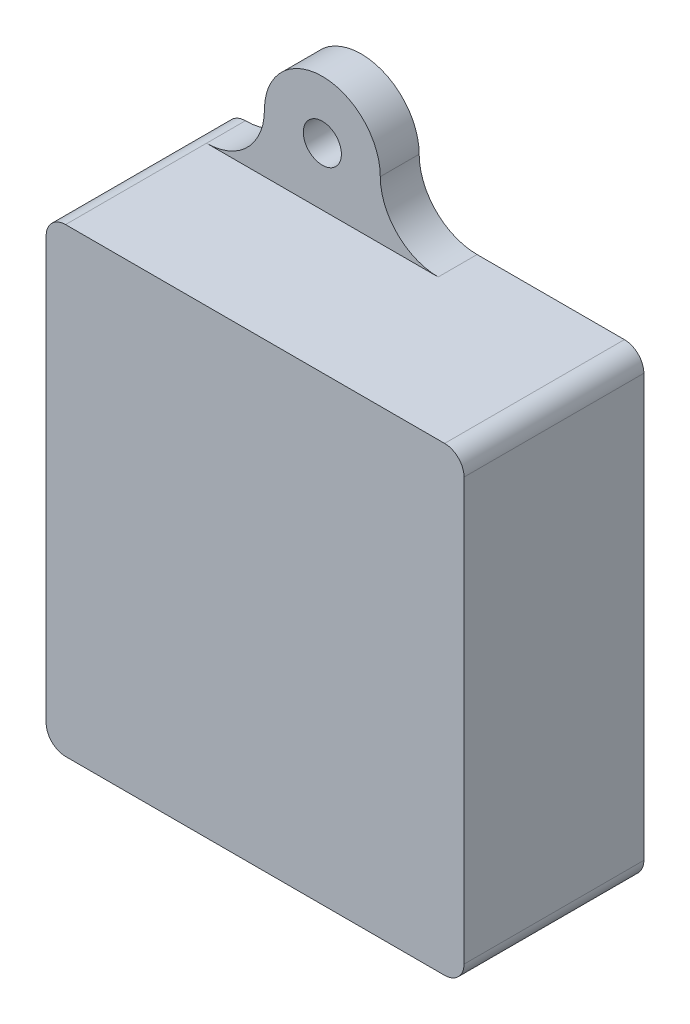
ISO-10303-21;
HEADER;
FILE_DESCRIPTION(('STEP AP214'),'2;1');
FILE_NAME('part.step','',(''),(''),'','','');
FILE_SCHEMA(('AUTOMOTIVE_DESIGN { 1 0 10303 214 1 1 1 1 }'));
ENDSEC;
DATA;
#1=APPLICATION_CONTEXT('core data for automotive mechanical design processes');
#2=APPLICATION_PROTOCOL_DEFINITION('international standard','automotive_design',2000,#1);
#3=PRODUCT_CONTEXT('',#1,'mechanical');
#4=PRODUCT('Part','Part','',(#3));
#5=PRODUCT_RELATED_PRODUCT_CATEGORY('part','',(#4));
#6=PRODUCT_DEFINITION_FORMATION('','',#4);
#7=PRODUCT_DEFINITION_CONTEXT('part definition',#1,'design');
#8=PRODUCT_DEFINITION('design','',#6,#7);
#9=PRODUCT_DEFINITION_SHAPE('','',#8);
#10=(LENGTH_UNIT() NAMED_UNIT(*) SI_UNIT(.MILLI.,.METRE.));
#11=(NAMED_UNIT(*) PLANE_ANGLE_UNIT() SI_UNIT($,.RADIAN.));
#12=(NAMED_UNIT(*) SI_UNIT($,.STERADIAN.) SOLID_ANGLE_UNIT());
#13=UNCERTAINTY_MEASURE_WITH_UNIT(LENGTH_MEASURE(1.E-05),#10,'distance_accuracy_value','');
#14=(GEOMETRIC_REPRESENTATION_CONTEXT(3) GLOBAL_UNCERTAINTY_ASSIGNED_CONTEXT((#13)) GLOBAL_UNIT_ASSIGNED_CONTEXT((#10,
#11,#12)) REPRESENTATION_CONTEXT('',''));
#15=CARTESIAN_POINT('',(0.,0.,0.));
#16=DIRECTION('',(0.,0.,1.));
#17=DIRECTION('',(1.,0.,0.));
#18=AXIS2_PLACEMENT_3D('',#15,#16,#17);
#19=CARTESIAN_POINT('',(2.54000000000002,60.198,23.495));
#20=DIRECTION('',(0.,1.,0.));
#21=DIRECTION('',(0.,0.,1.));
#22=AXIS2_PLACEMENT_3D('',#19,#20,#21);
#23=PLANE('',#22);
#24=DIRECTION('',(1.,0.,0.));
#25=VECTOR('',#24,1.);
#26=CARTESIAN_POINT('',(2.54000000000002,60.198,0.));
#27=LINE('',#26,#25);
#28=CARTESIAN_POINT('',(32.8168,60.198,0.));
#29=VERTEX_POINT('',#28);
#30=CARTESIAN_POINT('',(52.07,60.198,0.));
#31=VERTEX_POINT('',#30);
#32=EDGE_CURVE('E370',#29,#31,#27,.T.);
#33=ORIENTED_EDGE('',*,*,#32,.F.);
#34=DIRECTION('',(0.,0.,-1.));
#35=VECTOR('',#34,1.);
#36=CARTESIAN_POINT('',(32.8168,60.198,5.08));
#37=LINE('',#36,#35);
#38=CARTESIAN_POINT('',(32.8168,60.198,5.08));
#39=VERTEX_POINT('',#38);
#40=EDGE_CURVE('E306',#39,#29,#37,.T.);
#41=ORIENTED_EDGE('',*,*,#40,.F.);
#42=DIRECTION('',(1.,0.,0.));
#43=VECTOR('',#42,1.);
#44=CARTESIAN_POINT('',(0.,60.198,5.08));
#45=LINE('',#44,#43);
#46=CARTESIAN_POINT('',(2.54000000000002,60.198,5.08));
#47=VERTEX_POINT('',#46);
#48=EDGE_CURVE('E282',#47,#39,#45,.T.);
#49=ORIENTED_EDGE('',*,*,#48,.F.);
#50=DIRECTION('',(0.,0.,-1.));
#51=VECTOR('',#50,1.);
#52=CARTESIAN_POINT('',(2.54000000000002,60.198,23.495));
#53=LINE('',#52,#51);
#54=CARTESIAN_POINT('',(2.54000000000002,60.198,23.495));
#55=VERTEX_POINT('',#54);
#56=EDGE_CURVE('E396',#55,#47,#53,.T.);
#57=ORIENTED_EDGE('',*,*,#56,.F.);
#58=DIRECTION('',(1.,0.,0.));
#59=VECTOR('',#58,1.);
#60=CARTESIAN_POINT('',(2.54000000000002,60.198,23.495));
#61=LINE('',#60,#59);
#62=CARTESIAN_POINT('',(52.07,60.198,23.495));
#63=VERTEX_POINT('',#62);
#64=EDGE_CURVE('E348',#55,#63,#61,.T.);
#65=ORIENTED_EDGE('',*,*,#64,.T.);
#66=DIRECTION('',(0.,0.,-1.));
#67=VECTOR('',#66,1.);
#68=CARTESIAN_POINT('',(52.07,60.198,23.495));
#69=LINE('',#68,#67);
#70=EDGE_CURVE('E393',#63,#31,#69,.T.);
#71=ORIENTED_EDGE('',*,*,#70,.T.);
#72=EDGE_LOOP('',(#33,#41,#49,#57,#65,#71));
#73=FACE_BOUND('',#72,.T.);
#74=ADVANCED_FACE('F34',(#73),#23,.T.);
#75=CARTESIAN_POINT('',(2.54,2.54,0.));
#76=DIRECTION('',(0.,0.,-1.));
#77=DIRECTION('',(-1.,0.,0.));
#78=AXIS2_PLACEMENT_3D('',#75,#76,#77);
#79=PLANE('',#78);
#80=DIRECTION('',(-1.,0.,0.));
#81=VECTOR('',#80,1.);
#82=CARTESIAN_POINT('',(54.611,5.96900000000002,0.));
#83=LINE('',#82,#81);
#84=CARTESIAN_POINT('',(2.37689755157233,5.96900000000002,0.));
#85=VERTEX_POINT('',#84);
#86=CARTESIAN_POINT('',(1.27,5.96900000000002,0.));
#87=VERTEX_POINT('',#86);
#88=EDGE_CURVE('E608',#85,#87,#83,.T.);
#89=ORIENTED_EDGE('',*,*,#88,.F.);
#90=CARTESIAN_POINT('',(2.37689755157233,4.69900000000002,0.));
#91=DIRECTION('',(0.,0.,-1.));
#92=DIRECTION('',(-1.,0.,0.));
#93=AXIS2_PLACEMENT_3D('',#90,#91,#92);
#94=CIRCLE('',#93,1.27);
#95=CARTESIAN_POINT('',(3.57426503438155,5.12233333333335,0.));
#96=VERTEX_POINT('',#95);
#97=EDGE_CURVE('E451',#85,#96,#94,.T.);
#98=ORIENTED_EDGE('',*,*,#97,.T.);
#99=CARTESIAN_POINT('',(5.969,5.969,0.));
#100=DIRECTION('',(0.,0.,-1.));
#101=DIRECTION('',(-1.,0.,0.));
#102=AXIS2_PLACEMENT_3D('',#99,#100,#101);
#103=CIRCLE('',#102,2.54);
#104=CARTESIAN_POINT('',(5.969,3.429,0.));
#105=VERTEX_POINT('',#104);
#106=EDGE_CURVE('E433',#96,#105,#103,.F.);
#107=ORIENTED_EDGE('',*,*,#106,.T.);
#108=DIRECTION('',(1.,0.,0.));
#109=VECTOR('',#108,1.);
#110=CARTESIAN_POINT('',(2.54,3.429,0.));
#111=LINE('',#110,#109);
#112=CARTESIAN_POINT('',(48.641,3.429,0.));
#113=VERTEX_POINT('',#112);
#114=EDGE_CURVE('E328',#105,#113,#111,.T.);
#115=ORIENTED_EDGE('',*,*,#114,.T.);
#116=CARTESIAN_POINT('',(48.641,5.969,0.));
#117=DIRECTION('',(0.,0.,-1.));
#118=DIRECTION('',(-1.,0.,0.));
#119=AXIS2_PLACEMENT_3D('',#116,#117,#118);
#120=CIRCLE('',#119,2.54);
#121=CARTESIAN_POINT('',(51.181,5.969,0.));
#122=VERTEX_POINT('',#121);
#123=EDGE_CURVE('E435',#113,#122,#120,.F.);
#124=ORIENTED_EDGE('',*,*,#123,.T.);
#125=DIRECTION('',(0.,1.,0.));
#126=VECTOR('',#125,1.);
#127=CARTESIAN_POINT('',(51.181,2.54,0.));
#128=LINE('',#127,#126);
#129=CARTESIAN_POINT('',(51.181,54.229,0.));
#130=VERTEX_POINT('',#129);
#131=EDGE_CURVE('E331',#122,#130,#128,.T.);
#132=ORIENTED_EDGE('',*,*,#131,.T.);
#133=CARTESIAN_POINT('',(48.641,54.229,0.));
#134=DIRECTION('',(0.,0.,-1.));
#135=DIRECTION('',(-1.,0.,0.));
#136=AXIS2_PLACEMENT_3D('',#133,#134,#135);
#137=CIRCLE('',#136,2.54);
#138=CARTESIAN_POINT('',(48.641,56.769,0.));
#139=VERTEX_POINT('',#138);
#140=EDGE_CURVE('E437',#130,#139,#137,.F.);
#141=ORIENTED_EDGE('',*,*,#140,.T.);
#142=DIRECTION('',(1.,0.,0.));
#143=VECTOR('',#142,1.);
#144=CARTESIAN_POINT('',(2.54,56.769,0.));
#145=LINE('',#144,#143);
#146=CARTESIAN_POINT('',(5.969,56.769,0.));
#147=VERTEX_POINT('',#146);
#148=EDGE_CURVE('E333',#147,#139,#145,.T.);
#149=ORIENTED_EDGE('',*,*,#148,.F.);
#150=CARTESIAN_POINT('',(5.969,54.229,0.));
#151=DIRECTION('',(0.,0.,-1.));
#152=DIRECTION('',(-1.,0.,0.));
#153=AXIS2_PLACEMENT_3D('',#150,#151,#152);
#154=CIRCLE('',#153,2.54);
#155=CARTESIAN_POINT('',(3.429,54.229,0.));
#156=VERTEX_POINT('',#155);
#157=EDGE_CURVE('E430',#147,#156,#154,.F.);
#158=ORIENTED_EDGE('',*,*,#157,.T.);
#159=DIRECTION('',(0.,1.,0.));
#160=VECTOR('',#159,1.);
#161=CARTESIAN_POINT('',(3.429,2.54,0.));
#162=LINE('',#161,#160);
#163=CARTESIAN_POINT('',(3.429,47.5742,0.));
#164=VERTEX_POINT('',#163);
#165=EDGE_CURVE('E308',#164,#156,#162,.T.);
#166=ORIENTED_EDGE('',*,*,#165,.F.);
#167=CARTESIAN_POINT('',(2.159,47.5742,0.));
#168=DIRECTION('',(0.,0.,-1.));
#169=DIRECTION('',(-1.,0.,0.));
#170=AXIS2_PLACEMENT_3D('',#167,#168,#169);
#171=CIRCLE('',#170,1.27);
#172=CARTESIAN_POINT('',(2.159,46.3042,0.));
#173=VERTEX_POINT('',#172);
#174=EDGE_CURVE('E449',#164,#173,#171,.T.);
#175=ORIENTED_EDGE('',*,*,#174,.T.);
#176=DIRECTION('',(-1.,0.,0.));
#177=VECTOR('',#176,1.);
#178=CARTESIAN_POINT('',(54.611,46.3042,0.));
#179=LINE('',#178,#177);
#180=CARTESIAN_POINT('',(1.27,46.3042,0.));
#181=VERTEX_POINT('',#180);
#182=EDGE_CURVE('E271',#173,#181,#179,.T.);
#183=ORIENTED_EDGE('',*,*,#182,.T.);
#184=CARTESIAN_POINT('',(1.27,47.5742,0.));
#185=DIRECTION('',(0.,0.,-1.));
#186=DIRECTION('',(-1.,0.,0.));
#187=AXIS2_PLACEMENT_3D('',#184,#185,#186);
#188=CIRCLE('',#187,1.27);
#189=CARTESIAN_POINT('',(0.,47.5742,0.));
#190=VERTEX_POINT('',#189);
#191=EDGE_CURVE('E447',#181,#190,#188,.T.);
#192=ORIENTED_EDGE('',*,*,#191,.T.);
#193=DIRECTION('',(0.,1.,0.));
#194=VECTOR('',#193,1.);
#195=CARTESIAN_POINT('',(0.,2.54000000000002,0.));
#196=LINE('',#195,#194);
#197=CARTESIAN_POINT('',(0.,57.658,0.));
#198=VERTEX_POINT('',#197);
#199=EDGE_CURVE('E363',#190,#198,#196,.T.);
#200=ORIENTED_EDGE('',*,*,#199,.T.);
#201=CARTESIAN_POINT('',(2.54,57.658,0.));
#202=DIRECTION('',(0.,0.,-1.));
#203=DIRECTION('',(-1.,0.,0.));
#204=AXIS2_PLACEMENT_3D('',#201,#202,#203);
#205=CIRCLE('',#204,2.54);
#206=CARTESIAN_POINT('',(2.54000000000002,60.198,0.));
#207=VERTEX_POINT('',#206);
#208=EDGE_CURVE('E367',#198,#207,#205,.T.);
#209=ORIENTED_EDGE('',*,*,#208,.T.);
#210=CARTESIAN_POINT('',(2.54000000000002,67.7672,0.));
#211=DIRECTION('',(0.,0.,-1.));
#212=DIRECTION('',(-1.,0.,0.));
#213=AXIS2_PLACEMENT_3D('',#210,#211,#212);
#214=CIRCLE('',#213,7.56919999999997);
#215=CARTESIAN_POINT('',(10.1092,67.7672,0.));
#216=VERTEX_POINT('',#215);
#217=EDGE_CURVE('E277',#216,#207,#214,.T.);
#218=ORIENTED_EDGE('',*,*,#217,.F.);
#219=CARTESIAN_POINT('',(17.6784,67.7672,0.));
#220=DIRECTION('',(0.,0.,-1.));
#221=DIRECTION('',(-1.,0.,0.));
#222=AXIS2_PLACEMENT_3D('',#219,#220,#221);
#223=CIRCLE('',#222,7.5692);
#224=CARTESIAN_POINT('',(25.2476,67.7672,0.));
#225=VERTEX_POINT('',#224);
#226=EDGE_CURVE('E298',#216,#225,#223,.T.);
#227=ORIENTED_EDGE('',*,*,#226,.T.);
#228=CARTESIAN_POINT('',(32.8168,67.7672,0.));
#229=DIRECTION('',(0.,0.,-1.));
#230=DIRECTION('',(-1.,0.,0.));
#231=AXIS2_PLACEMENT_3D('',#228,#229,#230);
#232=CIRCLE('',#231,7.5692);
#233=EDGE_CURVE('E301',#225,#29,#232,.F.);
#234=ORIENTED_EDGE('',*,*,#233,.T.);
#235=ORIENTED_EDGE('',*,*,#32,.T.);
#236=CARTESIAN_POINT('',(52.07,57.658,0.));
#237=DIRECTION('',(0.,0.,-1.));
#238=DIRECTION('',(-1.,0.,0.));
#239=AXIS2_PLACEMENT_3D('',#236,#237,#238);
#240=CIRCLE('',#239,2.54);
#241=CARTESIAN_POINT('',(54.61,57.658,0.));
#242=VERTEX_POINT('',#241);
#243=EDGE_CURVE('E372',#31,#242,#240,.T.);
#244=ORIENTED_EDGE('',*,*,#243,.T.);
#245=DIRECTION('',(0.,1.,0.));
#246=VECTOR('',#245,1.);
#247=CARTESIAN_POINT('',(54.61,2.54,0.));
#248=LINE('',#247,#246);
#249=CARTESIAN_POINT('',(54.61,2.54,0.));
#250=VERTEX_POINT('',#249);
#251=EDGE_CURVE('E375',#250,#242,#248,.T.);
#252=ORIENTED_EDGE('',*,*,#251,.F.);
#253=CARTESIAN_POINT('',(52.07,2.54,0.));
#254=DIRECTION('',(0.,0.,1.));
#255=DIRECTION('',(1.,0.,0.));
#256=AXIS2_PLACEMENT_3D('',#253,#254,#255);
#257=CIRCLE('',#256,2.54);
#258=CARTESIAN_POINT('',(52.07,0.,0.));
#259=VERTEX_POINT('',#258);
#260=EDGE_CURVE('E378',#259,#250,#257,.T.);
#261=ORIENTED_EDGE('',*,*,#260,.F.);
#262=DIRECTION('',(1.,0.,0.));
#263=VECTOR('',#262,1.);
#264=CARTESIAN_POINT('',(2.54000000000002,0.,0.));
#265=LINE('',#264,#263);
#266=CARTESIAN_POINT('',(32.8168,0.,0.));
#267=VERTEX_POINT('',#266);
#268=EDGE_CURVE('E342',#267,#259,#265,.T.);
#269=ORIENTED_EDGE('',*,*,#268,.F.);
#270=CARTESIAN_POINT('',(32.8168,-7.56920000000003,0.));
#271=DIRECTION('',(0.,0.,-1.));
#272=DIRECTION('',(-1.,0.,0.));
#273=AXIS2_PLACEMENT_3D('',#270,#271,#272);
#274=CIRCLE('',#273,7.56920000000003);
#275=CARTESIAN_POINT('',(25.2476,-7.56920000000002,0.));
#276=VERTEX_POINT('',#275);
#277=EDGE_CURVE('E261',#276,#267,#274,.T.);
#278=ORIENTED_EDGE('',*,*,#277,.F.);
#279=CARTESIAN_POINT('',(17.6784,-7.5692,0.));
#280=DIRECTION('',(0.,0.,-1.));
#281=DIRECTION('',(-1.,0.,0.));
#282=AXIS2_PLACEMENT_3D('',#279,#280,#281);
#283=CIRCLE('',#282,7.56919999999997);
#284=CARTESIAN_POINT('',(10.1092,-7.5692,0.));
#285=VERTEX_POINT('',#284);
#286=EDGE_CURVE('E270',#276,#285,#283,.T.);
#287=ORIENTED_EDGE('',*,*,#286,.T.);
#288=CARTESIAN_POINT('',(2.54000000000002,-7.5692,0.));
#289=DIRECTION('',(0.,0.,-1.));
#290=DIRECTION('',(-1.,0.,0.));
#291=AXIS2_PLACEMENT_3D('',#288,#289,#290);
#292=CIRCLE('',#291,7.5692);
#293=CARTESIAN_POINT('',(2.54000000000002,0.,0.));
#294=VERTEX_POINT('',#293);
#295=EDGE_CURVE('E239',#285,#294,#292,.F.);
#296=ORIENTED_EDGE('',*,*,#295,.T.);
#297=CARTESIAN_POINT('',(2.54,2.54,0.));
#298=DIRECTION('',(0.,0.,-1.));
#299=DIRECTION('',(-1.,0.,0.));
#300=AXIS2_PLACEMENT_3D('',#297,#298,#299);
#301=CIRCLE('',#300,2.54);
#302=CARTESIAN_POINT('',(0.,2.54000000000002,0.));
#303=VERTEX_POINT('',#302);
#304=EDGE_CURVE('E318',#294,#303,#301,.T.);
#305=ORIENTED_EDGE('',*,*,#304,.T.);
#306=CARTESIAN_POINT('',(0.,4.69900000000002,0.));
#307=VERTEX_POINT('',#306);
#308=EDGE_CURVE('E364',#303,#307,#196,.T.);
#309=ORIENTED_EDGE('',*,*,#308,.T.);
#310=CARTESIAN_POINT('',(1.27,4.69900000000002,0.));
#311=DIRECTION('',(0.,0.,-1.));
#312=DIRECTION('',(-1.,0.,0.));
#313=AXIS2_PLACEMENT_3D('',#310,#311,#312);
#314=CIRCLE('',#313,1.27);
#315=EDGE_CURVE('E445',#307,#87,#314,.T.);
#316=ORIENTED_EDGE('',*,*,#315,.T.);
#317=EDGE_LOOP('',(#89,#98,#107,#115,#124,#132,#141,#149,#158,#166,#175,#183,#192,#200,#209,
#218,#227,#234,#235,#244,#252,#261,#269,#278,#287,#296,#305,#309,#316));
#318=FACE_BOUND('',#317,.T.);
#319=CARTESIAN_POINT('',(17.6784,67.7672,0.));
#320=DIRECTION('',(0.,0.,-1.));
#321=DIRECTION('',(-1.,0.,0.));
#322=AXIS2_PLACEMENT_3D('',#319,#320,#321);
#323=CIRCLE('',#322,2.48920000000001);
#324=CARTESIAN_POINT('',(15.1892,67.7672,0.));
#325=VERTEX_POINT('',#324);
#326=EDGE_CURVE('E285',#325,#325,#323,.T.);
#327=ORIENTED_EDGE('',*,*,#326,.F.);
#328=EDGE_LOOP('',(#327));
#329=FACE_BOUND('',#328,.T.);
#330=CARTESIAN_POINT('',(17.6784,-7.5692,0.));
#331=DIRECTION('',(0.,0.,-1.));
#332=DIRECTION('',(-1.,0.,0.));
#333=AXIS2_PLACEMENT_3D('',#330,#331,#332);
#334=CIRCLE('',#333,2.48919999999997);
#335=CARTESIAN_POINT('',(15.1892,-7.5692,0.));
#336=VERTEX_POINT('',#335);
#337=EDGE_CURVE('E267',#336,#336,#334,.T.);
#338=ORIENTED_EDGE('',*,*,#337,.F.);
#339=EDGE_LOOP('',(#338));
#340=FACE_BOUND('',#339,.T.);
#341=ADVANCED_FACE('F494',(#318,#329,#340),#79,.T.);
#342=CARTESIAN_POINT('',(2.54,2.54,23.495));
#343=DIRECTION('',(0.,0.,-1.));
#344=DIRECTION('',(-1.,0.,0.));
#345=AXIS2_PLACEMENT_3D('',#342,#343,#344);
#346=CYLINDRICAL_SURFACE('',#345,2.54);
#347=ORIENTED_EDGE('',*,*,#304,.F.);
#348=DIRECTION('',(0.,0.,-1.));
#349=VECTOR('',#348,1.);
#350=CARTESIAN_POINT('',(2.54000000000002,0.,5.08));
#351=LINE('',#350,#349);
#352=CARTESIAN_POINT('',(2.54000000000002,0.,5.08));
#353=VERTEX_POINT('',#352);
#354=EDGE_CURVE('E244',#353,#294,#351,.T.);
#355=ORIENTED_EDGE('',*,*,#354,.F.);
#356=DIRECTION('',(0.,0.,-1.));
#357=VECTOR('',#356,1.);
#358=CARTESIAN_POINT('',(2.54000000000002,0.,23.495));
#359=LINE('',#358,#357);
#360=CARTESIAN_POINT('',(2.54000000000002,0.,23.495));
#361=VERTEX_POINT('',#360);
#362=EDGE_CURVE('E381',#361,#353,#359,.T.);
#363=ORIENTED_EDGE('',*,*,#362,.F.);
#364=CARTESIAN_POINT('',(2.54,2.54,23.495));
#365=DIRECTION('',(0.,0.,-1.));
#366=DIRECTION('',(-1.,0.,0.));
#367=AXIS2_PLACEMENT_3D('',#364,#365,#366);
#368=CIRCLE('',#367,2.54);
#369=CARTESIAN_POINT('',(0.,2.54000000000002,23.495));
#370=VERTEX_POINT('',#369);
#371=EDGE_CURVE('E338',#361,#370,#368,.T.);
#372=ORIENTED_EDGE('',*,*,#371,.T.);
#373=DIRECTION('',(0.,0.,-1.));
#374=VECTOR('',#373,1.);
#375=CARTESIAN_POINT('',(0.,2.54000000000002,23.495));
#376=LINE('',#375,#374);
#377=EDGE_CURVE('E360',#370,#303,#376,.T.);
#378=ORIENTED_EDGE('',*,*,#377,.T.);
#379=EDGE_LOOP('',(#347,#355,#363,#372,#378));
#380=FACE_BOUND('',#379,.T.);
#381=ADVANCED_FACE('F560',(#380),#346,.T.);
#382=CARTESIAN_POINT('',(2.54000000000002,0.,23.495));
#383=DIRECTION('',(0.,1.,0.));
#384=DIRECTION('',(0.,0.,1.));
#385=AXIS2_PLACEMENT_3D('',#382,#383,#384);
#386=PLANE('',#385);
#387=DIRECTION('',(-1.,0.,0.));
#388=VECTOR('',#387,1.);
#389=CARTESIAN_POINT('',(0.,0.,5.08));
#390=LINE('',#389,#388);
#391=CARTESIAN_POINT('',(32.8168,0.,5.08));
#392=VERTEX_POINT('',#391);
#393=EDGE_CURVE('E253',#392,#353,#390,.T.);
#394=ORIENTED_EDGE('',*,*,#393,.F.);
#395=DIRECTION('',(0.,0.,-1.));
#396=VECTOR('',#395,1.);
#397=CARTESIAN_POINT('',(32.8168,0.,5.08));
#398=LINE('',#397,#396);
#399=EDGE_CURVE('E278',#392,#267,#398,.T.);
#400=ORIENTED_EDGE('',*,*,#399,.T.);
#401=ORIENTED_EDGE('',*,*,#268,.T.);
#402=DIRECTION('',(0.,0.,-1.));
#403=VECTOR('',#402,1.);
#404=CARTESIAN_POINT('',(52.07,0.,23.495));
#405=LINE('',#404,#403);
#406=CARTESIAN_POINT('',(52.07,0.,23.495));
#407=VERTEX_POINT('',#406);
#408=EDGE_CURVE('E385',#407,#259,#405,.T.);
#409=ORIENTED_EDGE('',*,*,#408,.F.);
#410=DIRECTION('',(1.,0.,0.));
#411=VECTOR('',#410,1.);
#412=CARTESIAN_POINT('',(2.54000000000002,0.,23.495));
#413=LINE('',#412,#411);
#414=EDGE_CURVE('E358',#361,#407,#413,.T.);
#415=ORIENTED_EDGE('',*,*,#414,.F.);
#416=ORIENTED_EDGE('',*,*,#362,.T.);
#417=EDGE_LOOP('',(#394,#400,#401,#409,#415,#416));
#418=FACE_BOUND('',#417,.T.);
#419=ADVANCED_FACE('F536',(#418),#386,.F.);
#420=CARTESIAN_POINT('',(52.07,2.54,23.495));
#421=DIRECTION('',(0.,0.,-1.));
#422=DIRECTION('',(-1.,0.,0.));
#423=AXIS2_PLACEMENT_3D('',#420,#421,#422);
#424=CYLINDRICAL_SURFACE('',#423,2.54);
#425=ORIENTED_EDGE('',*,*,#260,.T.);
#426=DIRECTION('',(0.,0.,-1.));
#427=VECTOR('',#426,1.);
#428=CARTESIAN_POINT('',(54.61,2.54,23.495));
#429=LINE('',#428,#427);
#430=CARTESIAN_POINT('',(54.61,2.54,23.495));
#431=VERTEX_POINT('',#430);
#432=EDGE_CURVE('E388',#431,#250,#429,.T.);
#433=ORIENTED_EDGE('',*,*,#432,.F.);
#434=CARTESIAN_POINT('',(52.07,2.54,23.495));
#435=DIRECTION('',(0.,0.,1.));
#436=DIRECTION('',(1.,0.,0.));
#437=AXIS2_PLACEMENT_3D('',#434,#435,#436);
#438=CIRCLE('',#437,2.54);
#439=EDGE_CURVE('E356',#407,#431,#438,.T.);
#440=ORIENTED_EDGE('',*,*,#439,.F.);
#441=ORIENTED_EDGE('',*,*,#408,.T.);
#442=EDGE_LOOP('',(#425,#433,#440,#441));
#443=FACE_BOUND('',#442,.T.);
#444=ADVANCED_FACE('F532',(#443),#424,.T.);
#445=CARTESIAN_POINT('',(54.61,2.54,23.495));
#446=DIRECTION('',(-1.,0.,0.));
#447=DIRECTION('',(0.,0.,1.));
#448=AXIS2_PLACEMENT_3D('',#445,#446,#447);
#449=PLANE('',#448);
#450=ORIENTED_EDGE('',*,*,#251,.T.);
#451=DIRECTION('',(0.,0.,-1.));
#452=VECTOR('',#451,1.);
#453=CARTESIAN_POINT('',(54.61,57.658,23.495));
#454=LINE('',#453,#452);
#455=CARTESIAN_POINT('',(54.61,57.658,23.495));
#456=VERTEX_POINT('',#455);
#457=EDGE_CURVE('E391',#456,#242,#454,.T.);
#458=ORIENTED_EDGE('',*,*,#457,.F.);
#459=DIRECTION('',(0.,1.,0.));
#460=VECTOR('',#459,1.);
#461=CARTESIAN_POINT('',(54.61,2.54,23.495));
#462=LINE('',#461,#460);
#463=EDGE_CURVE('E354',#431,#456,#462,.T.);
#464=ORIENTED_EDGE('',*,*,#463,.F.);
#465=ORIENTED_EDGE('',*,*,#432,.T.);
#466=EDGE_LOOP('',(#450,#458,#464,#465));
#467=FACE_BOUND('',#466,.T.);
#468=ADVANCED_FACE('F527',(#467),#449,.F.);
#469=CARTESIAN_POINT('',(52.07,57.658,23.495));
#470=DIRECTION('',(0.,0.,-1.));
#471=DIRECTION('',(-1.,0.,0.));
#472=AXIS2_PLACEMENT_3D('',#469,#470,#471);
#473=CYLINDRICAL_SURFACE('',#472,2.54);
#474=ORIENTED_EDGE('',*,*,#243,.F.);
#475=ORIENTED_EDGE('',*,*,#70,.F.);
#476=CARTESIAN_POINT('',(52.07,57.658,23.495));
#477=DIRECTION('',(0.,0.,-1.));
#478=DIRECTION('',(-1.,0.,0.));
#479=AXIS2_PLACEMENT_3D('',#476,#477,#478);
#480=CIRCLE('',#479,2.54);
#481=EDGE_CURVE('E351',#63,#456,#480,.T.);
#482=ORIENTED_EDGE('',*,*,#481,.T.);
#483=ORIENTED_EDGE('',*,*,#457,.T.);
#484=EDGE_LOOP('',(#474,#475,#482,#483));
#485=FACE_BOUND('',#484,.T.);
#486=ADVANCED_FACE('F522',(#485),#473,.T.);
#487=CARTESIAN_POINT('',(2.54,57.658,23.495));
#488=DIRECTION('',(0.,0.,-1.));
#489=DIRECTION('',(-1.,0.,0.));
#490=AXIS2_PLACEMENT_3D('',#487,#488,#489);
#491=CYLINDRICAL_SURFACE('',#490,2.54);
#492=ORIENTED_EDGE('',*,*,#208,.F.);
#493=DIRECTION('',(0.,0.,-1.));
#494=VECTOR('',#493,1.);
#495=CARTESIAN_POINT('',(0.,57.658,23.495));
#496=LINE('',#495,#494);
#497=CARTESIAN_POINT('',(0.,57.658,23.495));
#498=VERTEX_POINT('',#497);
#499=EDGE_CURVE('E399',#498,#198,#496,.T.);
#500=ORIENTED_EDGE('',*,*,#499,.F.);
#501=CARTESIAN_POINT('',(2.54,57.658,23.495));
#502=DIRECTION('',(0.,0.,-1.));
#503=DIRECTION('',(-1.,0.,0.));
#504=AXIS2_PLACEMENT_3D('',#501,#502,#503);
#505=CIRCLE('',#504,2.54);
#506=EDGE_CURVE('E345',#498,#55,#505,.T.);
#507=ORIENTED_EDGE('',*,*,#506,.T.);
#508=ORIENTED_EDGE('',*,*,#56,.T.);
#509=DIRECTION('',(0.,0.,-1.));
#510=VECTOR('',#509,1.);
#511=CARTESIAN_POINT('',(2.54000000000002,60.198,5.08));
#512=LINE('',#511,#510);
#513=EDGE_CURVE('E296',#47,#207,#512,.T.);
#514=ORIENTED_EDGE('',*,*,#513,.T.);
#515=EDGE_LOOP('',(#492,#500,#507,#508,#514));
#516=FACE_BOUND('',#515,.T.);
#517=ADVANCED_FACE('F501',(#516),#491,.T.);
#518=CARTESIAN_POINT('',(0.,2.54000000000002,23.495));
#519=DIRECTION('',(-1.,0.,0.));
#520=DIRECTION('',(0.,0.,1.));
#521=AXIS2_PLACEMENT_3D('',#518,#519,#520);
#522=PLANE('',#521);
#523=ORIENTED_EDGE('',*,*,#199,.F.);
#524=DIRECTION('',(0.,0.,-1.));
#525=VECTOR('',#524,1.);
#526=CARTESIAN_POINT('',(0.,47.5742,3.81));
#527=LINE('',#526,#525);
#528=CARTESIAN_POINT('',(0.,47.5742,3.81));
#529=VERTEX_POINT('',#528);
#530=EDGE_CURVE('E468',#190,#529,#527,.F.);
#531=ORIENTED_EDGE('',*,*,#530,.T.);
#532=DIRECTION('',(0.,1.,0.));
#533=VECTOR('',#532,1.);
#534=CARTESIAN_POINT('',(0.,46.3042,3.81));
#535=LINE('',#534,#533);
#536=CARTESIAN_POINT('',(0.,4.69900000000002,3.81000000000001));
#537=VERTEX_POINT('',#536);
#538=EDGE_CURVE('E48',#537,#529,#535,.T.);
#539=ORIENTED_EDGE('',*,*,#538,.F.);
#540=DIRECTION('',(0.,0.,1.));
#541=VECTOR('',#540,1.);
#542=CARTESIAN_POINT('',(0.,4.69900000000002,0.));
#543=LINE('',#542,#541);
#544=EDGE_CURVE('E466',#537,#307,#543,.F.);
#545=ORIENTED_EDGE('',*,*,#544,.T.);
#546=ORIENTED_EDGE('',*,*,#308,.F.);
#547=ORIENTED_EDGE('',*,*,#377,.F.);
#548=DIRECTION('',(0.,1.,0.));
#549=VECTOR('',#548,1.);
#550=CARTESIAN_POINT('',(0.,2.54000000000002,23.495));
#551=LINE('',#550,#549);
#552=EDGE_CURVE('E341',#370,#498,#551,.T.);
#553=ORIENTED_EDGE('',*,*,#552,.T.);
#554=ORIENTED_EDGE('',*,*,#499,.T.);
#555=EDGE_LOOP('',(#523,#531,#539,#545,#546,#547,#553,#554));
#556=FACE_BOUND('',#555,.T.);
#557=ADVANCED_FACE('F496',(#556),#522,.T.);
#558=CARTESIAN_POINT('',(2.54,2.54,23.495));
#559=DIRECTION('',(0.,0.,-1.));
#560=DIRECTION('',(-1.,0.,0.));
#561=AXIS2_PLACEMENT_3D('',#558,#559,#560);
#562=PLANE('',#561);
#563=ORIENTED_EDGE('',*,*,#371,.F.);
#564=ORIENTED_EDGE('',*,*,#414,.T.);
#565=ORIENTED_EDGE('',*,*,#439,.T.);
#566=ORIENTED_EDGE('',*,*,#463,.T.);
#567=ORIENTED_EDGE('',*,*,#481,.F.);
#568=ORIENTED_EDGE('',*,*,#64,.F.);
#569=ORIENTED_EDGE('',*,*,#506,.F.);
#570=ORIENTED_EDGE('',*,*,#552,.F.);
#571=EDGE_LOOP('',(#563,#564,#565,#566,#567,#568,#569,#570));
#572=FACE_BOUND('',#571,.T.);
#573=ADVANCED_FACE('F569',(#572),#562,.F.);
#574=CARTESIAN_POINT('',(2.54000000000002,3.429,23.495));
#575=DIRECTION('',(0.,1.,0.));
#576=DIRECTION('',(0.,0.,1.));
#577=AXIS2_PLACEMENT_3D('',#574,#575,#576);
#578=PLANE('',#577);
#579=ORIENTED_EDGE('',*,*,#114,.F.);
#580=DIRECTION('',(0.,0.,-1.));
#581=VECTOR('',#580,1.);
#582=CARTESIAN_POINT('',(5.969,3.429,23.495));
#583=LINE('',#582,#581);
#584=CARTESIAN_POINT('',(5.969,3.429,20.066));
#585=VERTEX_POINT('',#584);
#586=EDGE_CURVE('E423',#105,#585,#583,.F.);
#587=ORIENTED_EDGE('',*,*,#586,.T.);
#588=DIRECTION('',(1.,0.,0.));
#589=VECTOR('',#588,1.);
#590=CARTESIAN_POINT('',(2.54,3.429,20.066));
#591=LINE('',#590,#589);
#592=CARTESIAN_POINT('',(48.641,3.429,20.066));
#593=VERTEX_POINT('',#592);
#594=EDGE_CURVE('E315',#585,#593,#591,.T.);
#595=ORIENTED_EDGE('',*,*,#594,.T.);
#596=DIRECTION('',(0.,0.,-1.));
#597=VECTOR('',#596,1.);
#598=CARTESIAN_POINT('',(48.641,3.429,0.));
#599=LINE('',#598,#597);
#600=EDGE_CURVE('E420',#593,#113,#599,.T.);
#601=ORIENTED_EDGE('',*,*,#600,.T.);
#602=EDGE_LOOP('',(#579,#587,#595,#601));
#603=FACE_BOUND('',#602,.T.);
#604=ADVANCED_FACE('F632',(#603),#578,.T.);
#605=CARTESIAN_POINT('',(51.181,2.54,23.495));
#606=DIRECTION('',(-1.,0.,0.));
#607=DIRECTION('',(0.,0.,1.));
#608=AXIS2_PLACEMENT_3D('',#605,#606,#607);
#609=PLANE('',#608);
#610=ORIENTED_EDGE('',*,*,#131,.F.);
#611=DIRECTION('',(0.,0.,-1.));
#612=VECTOR('',#611,1.);
#613=CARTESIAN_POINT('',(51.181,5.969,20.066));
#614=LINE('',#613,#612);
#615=CARTESIAN_POINT('',(51.181,5.969,20.066));
#616=VERTEX_POINT('',#615);
#617=EDGE_CURVE('E428',#122,#616,#614,.F.);
#618=ORIENTED_EDGE('',*,*,#617,.T.);
#619=DIRECTION('',(0.,1.,0.));
#620=VECTOR('',#619,1.);
#621=CARTESIAN_POINT('',(51.181,2.54,20.066));
#622=LINE('',#621,#620);
#623=CARTESIAN_POINT('',(51.181,54.229,20.066));
#624=VERTEX_POINT('',#623);
#625=EDGE_CURVE('E319',#616,#624,#622,.T.);
#626=ORIENTED_EDGE('',*,*,#625,.T.);
#627=DIRECTION('',(0.,0.,-1.));
#628=VECTOR('',#627,1.);
#629=CARTESIAN_POINT('',(51.181,54.229,23.495));
#630=LINE('',#629,#628);
#631=EDGE_CURVE('E425',#624,#130,#630,.T.);
#632=ORIENTED_EDGE('',*,*,#631,.T.);
#633=EDGE_LOOP('',(#610,#618,#626,#632));
#634=FACE_BOUND('',#633,.T.);
#635=ADVANCED_FACE('F639',(#634),#609,.T.);
#636=CARTESIAN_POINT('',(2.54000000000002,56.769,23.495));
#637=DIRECTION('',(0.,1.,0.));
#638=DIRECTION('',(0.,0.,1.));
#639=AXIS2_PLACEMENT_3D('',#636,#637,#638);
#640=PLANE('',#639);
#641=DIRECTION('',(1.,0.,0.));
#642=VECTOR('',#641,1.);
#643=CARTESIAN_POINT('',(2.54,56.769,20.066));
#644=LINE('',#643,#642);
#645=CARTESIAN_POINT('',(5.969,56.769,20.066));
#646=VERTEX_POINT('',#645);
#647=CARTESIAN_POINT('',(48.641,56.769,20.066));
#648=VERTEX_POINT('',#647);
#649=EDGE_CURVE('E322',#646,#648,#644,.T.);
#650=ORIENTED_EDGE('',*,*,#649,.F.);
#651=DIRECTION('',(0.,0.,-1.));
#652=VECTOR('',#651,1.);
#653=CARTESIAN_POINT('',(5.969,56.769,0.));
#654=LINE('',#653,#652);
#655=EDGE_CURVE('E404',#646,#147,#654,.T.);
#656=ORIENTED_EDGE('',*,*,#655,.T.);
#657=ORIENTED_EDGE('',*,*,#148,.T.);
#658=DIRECTION('',(0.,0.,-1.));
#659=VECTOR('',#658,1.);
#660=CARTESIAN_POINT('',(48.641,56.769,23.495));
#661=LINE('',#660,#659);
#662=EDGE_CURVE('E384',#139,#648,#661,.F.);
#663=ORIENTED_EDGE('',*,*,#662,.T.);
#664=EDGE_LOOP('',(#650,#656,#657,#663));
#665=FACE_BOUND('',#664,.T.);
#666=ADVANCED_FACE('F647',(#665),#640,.F.);
#667=CARTESIAN_POINT('',(3.429,2.54000000000002,23.495));
#668=DIRECTION('',(-1.,0.,0.));
#669=DIRECTION('',(0.,0.,1.));
#670=AXIS2_PLACEMENT_3D('',#667,#668,#669);
#671=PLANE('',#670);
#672=DIRECTION('',(0.,-1.,0.));
#673=VECTOR('',#672,1.);
#674=CARTESIAN_POINT('',(3.429,46.3042,3.81));
#675=LINE('',#674,#673);
#676=CARTESIAN_POINT('',(3.429,47.5742,3.81));
#677=VERTEX_POINT('',#676);
#678=CARTESIAN_POINT('',(3.429,5.969,3.81000000000001));
#679=VERTEX_POINT('',#678);
#680=EDGE_CURVE('E616',#677,#679,#675,.T.);
#681=ORIENTED_EDGE('',*,*,#680,.F.);
#682=DIRECTION('',(0.,0.,1.));
#683=VECTOR('',#682,1.);
#684=CARTESIAN_POINT('',(3.429,47.5742,23.495));
#685=LINE('',#684,#683);
#686=EDGE_CURVE('E464',#677,#164,#685,.F.);
#687=ORIENTED_EDGE('',*,*,#686,.T.);
#688=ORIENTED_EDGE('',*,*,#165,.T.);
#689=DIRECTION('',(0.,0.,-1.));
#690=VECTOR('',#689,1.);
#691=CARTESIAN_POINT('',(3.429,54.229,20.066));
#692=LINE('',#691,#690);
#693=CARTESIAN_POINT('',(3.429,54.229,20.066));
#694=VERTEX_POINT('',#693);
#695=EDGE_CURVE('E410',#156,#694,#692,.F.);
#696=ORIENTED_EDGE('',*,*,#695,.T.);
#697=DIRECTION('',(0.,1.,0.));
#698=VECTOR('',#697,1.);
#699=CARTESIAN_POINT('',(3.429,2.54,20.066));
#700=LINE('',#699,#698);
#701=CARTESIAN_POINT('',(3.429,5.969,20.066));
#702=VERTEX_POINT('',#701);
#703=EDGE_CURVE('E325',#702,#694,#700,.T.);
#704=ORIENTED_EDGE('',*,*,#703,.F.);
#705=DIRECTION('',(0.,0.,-1.));
#706=VECTOR('',#705,1.);
#707=CARTESIAN_POINT('',(3.429,5.969,23.495));
#708=LINE('',#707,#706);
#709=EDGE_CURVE('E407',#702,#679,#708,.T.);
#710=ORIENTED_EDGE('',*,*,#709,.T.);
#711=EDGE_LOOP('',(#681,#687,#688,#696,#704,#710));
#712=FACE_BOUND('',#711,.T.);
#713=ADVANCED_FACE('F624',(#712),#671,.F.);
#714=CARTESIAN_POINT('',(2.54,2.54,20.066));
#715=DIRECTION('',(0.,0.,-1.));
#716=DIRECTION('',(-1.,0.,0.));
#717=AXIS2_PLACEMENT_3D('',#714,#715,#716);
#718=PLANE('',#717);
#719=ORIENTED_EDGE('',*,*,#703,.T.);
#720=CARTESIAN_POINT('',(5.969,54.229,20.066));
#721=DIRECTION('',(0.,0.,-1.));
#722=DIRECTION('',(-1.,0.,0.));
#723=AXIS2_PLACEMENT_3D('',#720,#721,#722);
#724=CIRCLE('',#723,2.54);
#725=EDGE_CURVE('E418',#694,#646,#724,.T.);
#726=ORIENTED_EDGE('',*,*,#725,.T.);
#727=ORIENTED_EDGE('',*,*,#649,.T.);
#728=CARTESIAN_POINT('',(48.641,54.229,20.066));
#729=DIRECTION('',(0.,0.,-1.));
#730=DIRECTION('',(-1.,0.,0.));
#731=AXIS2_PLACEMENT_3D('',#728,#729,#730);
#732=CIRCLE('',#731,2.54);
#733=EDGE_CURVE('E412',#648,#624,#732,.T.);
#734=ORIENTED_EDGE('',*,*,#733,.T.);
#735=ORIENTED_EDGE('',*,*,#625,.F.);
#736=CARTESIAN_POINT('',(48.641,5.969,20.066));
#737=DIRECTION('',(0.,0.,-1.));
#738=DIRECTION('',(-1.,0.,0.));
#739=AXIS2_PLACEMENT_3D('',#736,#737,#738);
#740=CIRCLE('',#739,2.54);
#741=EDGE_CURVE('E414',#616,#593,#740,.T.);
#742=ORIENTED_EDGE('',*,*,#741,.T.);
#743=ORIENTED_EDGE('',*,*,#594,.F.);
#744=CARTESIAN_POINT('',(5.969,5.969,20.066));
#745=DIRECTION('',(0.,0.,-1.));
#746=DIRECTION('',(-1.,0.,0.));
#747=AXIS2_PLACEMENT_3D('',#744,#745,#746);
#748=CIRCLE('',#747,2.54);
#749=EDGE_CURVE('E416',#585,#702,#748,.T.);
#750=ORIENTED_EDGE('',*,*,#749,.T.);
#751=EDGE_LOOP('',(#719,#726,#727,#734,#735,#742,#743,#750));
#752=FACE_BOUND('',#751,.T.);
#753=ADVANCED_FACE('F577',(#752),#718,.T.);
#754=CARTESIAN_POINT('',(5.969,54.229,23.495));
#755=DIRECTION('',(0.,0.,1.));
#756=DIRECTION('',(1.,0.,0.));
#757=AXIS2_PLACEMENT_3D('',#754,#755,#756);
#758=CYLINDRICAL_SURFACE('',#757,2.54);
#759=ORIENTED_EDGE('',*,*,#725,.F.);
#760=ORIENTED_EDGE('',*,*,#695,.F.);
#761=ORIENTED_EDGE('',*,*,#157,.F.);
#762=ORIENTED_EDGE('',*,*,#655,.F.);
#763=EDGE_LOOP('',(#759,#760,#761,#762));
#764=FACE_BOUND('',#763,.T.);
#765=ADVANCED_FACE('F573',(#764),#758,.F.);
#766=CARTESIAN_POINT('',(5.969,5.969,23.495));
#767=DIRECTION('',(0.,0.,-1.));
#768=DIRECTION('',(-1.,0.,0.));
#769=AXIS2_PLACEMENT_3D('',#766,#767,#768);
#770=CYLINDRICAL_SURFACE('',#769,2.54);
#771=ORIENTED_EDGE('',*,*,#106,.F.);
#772=DIRECTION('',(0.,0.,-1.));
#773=VECTOR('',#772,1.);
#774=CARTESIAN_POINT('',(3.57426503438155,5.12233333333335,23.495));
#775=LINE('',#774,#773);
#776=CARTESIAN_POINT('',(3.57426503438155,5.12233333333335,3.81000000000001));
#777=VERTEX_POINT('',#776);
#778=EDGE_CURVE('E455',#96,#777,#775,.F.);
#779=ORIENTED_EDGE('',*,*,#778,.T.);
#780=CARTESIAN_POINT('',(5.969,5.969,3.81000000000001));
#781=DIRECTION('',(0.,0.,1.));
#782=DIRECTION('',(0.,-1.,0.));
#783=AXIS2_PLACEMENT_3D('',#780,#781,#782);
#784=CIRCLE('',#783,2.54);
#785=EDGE_CURVE('E453',#777,#679,#784,.F.);
#786=ORIENTED_EDGE('',*,*,#785,.T.);
#787=ORIENTED_EDGE('',*,*,#709,.F.);
#788=ORIENTED_EDGE('',*,*,#749,.F.);
#789=ORIENTED_EDGE('',*,*,#586,.F.);
#790=EDGE_LOOP('',(#771,#779,#786,#787,#788,#789));
#791=FACE_BOUND('',#790,.T.);
#792=ADVANCED_FACE('F576',(#791),#770,.F.);
#793=CARTESIAN_POINT('',(48.641,5.969,23.495));
#794=DIRECTION('',(0.,0.,1.));
#795=DIRECTION('',(1.,0.,0.));
#796=AXIS2_PLACEMENT_3D('',#793,#794,#795);
#797=CYLINDRICAL_SURFACE('',#796,2.54);
#798=ORIENTED_EDGE('',*,*,#741,.F.);
#799=ORIENTED_EDGE('',*,*,#617,.F.);
#800=ORIENTED_EDGE('',*,*,#123,.F.);
#801=ORIENTED_EDGE('',*,*,#600,.F.);
#802=EDGE_LOOP('',(#798,#799,#800,#801));
#803=FACE_BOUND('',#802,.T.);
#804=ADVANCED_FACE('F581',(#803),#797,.F.);
#805=CARTESIAN_POINT('',(48.641,54.229,23.495));
#806=DIRECTION('',(0.,0.,-1.));
#807=DIRECTION('',(-1.,0.,0.));
#808=AXIS2_PLACEMENT_3D('',#805,#806,#807);
#809=CYLINDRICAL_SURFACE('',#808,2.54);
#810=ORIENTED_EDGE('',*,*,#733,.F.);
#811=ORIENTED_EDGE('',*,*,#662,.F.);
#812=ORIENTED_EDGE('',*,*,#140,.F.);
#813=ORIENTED_EDGE('',*,*,#631,.F.);
#814=EDGE_LOOP('',(#810,#811,#812,#813));
#815=FACE_BOUND('',#814,.T.);
#816=ADVANCED_FACE('F585',(#815),#809,.F.);
#817=CARTESIAN_POINT('',(32.8168,67.7672,5.08));
#818=DIRECTION('',(0.,0.,-1.));
#819=DIRECTION('',(-1.,0.,0.));
#820=AXIS2_PLACEMENT_3D('',#817,#818,#819);
#821=CYLINDRICAL_SURFACE('',#820,7.5692);
#822=ORIENTED_EDGE('',*,*,#233,.F.);
#823=DIRECTION('',(0.,0.,-1.));
#824=VECTOR('',#823,1.);
#825=CARTESIAN_POINT('',(25.2476,67.7672,5.08));
#826=LINE('',#825,#824);
#827=CARTESIAN_POINT('',(25.2476,67.7672,5.08));
#828=VERTEX_POINT('',#827);
#829=EDGE_CURVE('E309',#828,#225,#826,.T.);
#830=ORIENTED_EDGE('',*,*,#829,.F.);
#831=CARTESIAN_POINT('',(32.8168,67.7672,5.08));
#832=DIRECTION('',(0.,0.,-1.));
#833=DIRECTION('',(-1.,0.,0.));
#834=AXIS2_PLACEMENT_3D('',#831,#832,#833);
#835=CIRCLE('',#834,7.5692);
#836=EDGE_CURVE('E290',#828,#39,#835,.F.);
#837=ORIENTED_EDGE('',*,*,#836,.T.);
#838=ORIENTED_EDGE('',*,*,#40,.T.);
#839=EDGE_LOOP('',(#822,#830,#837,#838));
#840=FACE_BOUND('',#839,.T.);
#841=ADVANCED_FACE('F513',(#840),#821,.F.);
#842=CARTESIAN_POINT('',(17.6784,67.7672,5.08));
#843=DIRECTION('',(0.,0.,-1.));
#844=DIRECTION('',(-1.,0.,0.));
#845=AXIS2_PLACEMENT_3D('',#842,#843,#844);
#846=CYLINDRICAL_SURFACE('',#845,7.5692);
#847=ORIENTED_EDGE('',*,*,#226,.F.);
#848=DIRECTION('',(0.,0.,-1.));
#849=VECTOR('',#848,1.);
#850=CARTESIAN_POINT('',(10.1092,67.7672,5.08));
#851=LINE('',#850,#849);
#852=CARTESIAN_POINT('',(10.1092,67.7672,5.08));
#853=VERTEX_POINT('',#852);
#854=EDGE_CURVE('E311',#853,#216,#851,.T.);
#855=ORIENTED_EDGE('',*,*,#854,.F.);
#856=CARTESIAN_POINT('',(17.6784,67.7672,5.08));
#857=DIRECTION('',(0.,0.,-1.));
#858=DIRECTION('',(-1.,0.,0.));
#859=AXIS2_PLACEMENT_3D('',#856,#857,#858);
#860=CIRCLE('',#859,7.5692);
#861=EDGE_CURVE('E287',#853,#828,#860,.T.);
#862=ORIENTED_EDGE('',*,*,#861,.T.);
#863=ORIENTED_EDGE('',*,*,#829,.T.);
#864=EDGE_LOOP('',(#847,#855,#862,#863));
#865=FACE_BOUND('',#864,.T.);
#866=ADVANCED_FACE('F508',(#865),#846,.T.);
#867=CARTESIAN_POINT('',(2.54000000000002,67.7672,5.08));
#868=DIRECTION('',(0.,0.,-1.));
#869=DIRECTION('',(-1.,0.,0.));
#870=AXIS2_PLACEMENT_3D('',#867,#868,#869);
#871=CYLINDRICAL_SURFACE('',#870,7.56919999999997);
#872=ORIENTED_EDGE('',*,*,#217,.T.);
#873=ORIENTED_EDGE('',*,*,#513,.F.);
#874=CARTESIAN_POINT('',(2.54000000000002,67.7672,5.08));
#875=DIRECTION('',(0.,0.,-1.));
#876=DIRECTION('',(-1.,0.,0.));
#877=AXIS2_PLACEMENT_3D('',#874,#875,#876);
#878=CIRCLE('',#877,7.56919999999997);
#879=EDGE_CURVE('E284',#853,#47,#878,.T.);
#880=ORIENTED_EDGE('',*,*,#879,.F.);
#881=ORIENTED_EDGE('',*,*,#854,.T.);
#882=EDGE_LOOP('',(#872,#873,#880,#881));
#883=FACE_BOUND('',#882,.T.);
#884=ADVANCED_FACE('F786',(#883),#871,.F.);
#885=CARTESIAN_POINT('',(17.6784,67.7672,5.08));
#886=DIRECTION('',(0.,0.,-1.));
#887=DIRECTION('',(-1.,0.,0.));
#888=AXIS2_PLACEMENT_3D('',#885,#886,#887);
#889=CYLINDRICAL_SURFACE('',#888,2.48920000000001);
#890=CARTESIAN_POINT('',(17.6784,67.7672,5.08));
#891=DIRECTION('',(0.,0.,-1.));
#892=DIRECTION('',(-1.,0.,0.));
#893=AXIS2_PLACEMENT_3D('',#890,#891,#892);
#894=CIRCLE('',#893,2.48920000000001);
#895=CARTESIAN_POINT('',(15.1892,67.7672,5.08));
#896=VERTEX_POINT('',#895);
#897=EDGE_CURVE('E293',#896,#896,#894,.T.);
#898=ORIENTED_EDGE('',*,*,#897,.F.);
#899=EDGE_LOOP('',(#898));
#900=FACE_BOUND('',#899,.T.);
#901=ORIENTED_EDGE('',*,*,#326,.T.);
#902=EDGE_LOOP('',(#901));
#903=FACE_BOUND('',#902,.T.);
#904=ADVANCED_FACE('F782',(#900,#903),#889,.F.);
#905=CARTESIAN_POINT('',(0.,0.,5.08));
#906=DIRECTION('',(0.,0.,-1.));
#907=DIRECTION('',(-1.,0.,0.));
#908=AXIS2_PLACEMENT_3D('',#905,#906,#907);
#909=PLANE('',#908);
#910=ORIENTED_EDGE('',*,*,#48,.T.);
#911=ORIENTED_EDGE('',*,*,#836,.F.);
#912=ORIENTED_EDGE('',*,*,#861,.F.);
#913=ORIENTED_EDGE('',*,*,#879,.T.);
#914=EDGE_LOOP('',(#910,#911,#912,#913));
#915=FACE_BOUND('',#914,.T.);
#916=ORIENTED_EDGE('',*,*,#897,.T.);
#917=EDGE_LOOP('',(#916));
#918=FACE_BOUND('',#917,.T.);
#919=ADVANCED_FACE('F551',(#915,#918),#909,.F.);
#920=CARTESIAN_POINT('',(17.6784,-7.5692,5.08));
#921=DIRECTION('',(0.,0.,-1.));
#922=DIRECTION('',(-1.,0.,0.));
#923=AXIS2_PLACEMENT_3D('',#920,#921,#922);
#924=CYLINDRICAL_SURFACE('',#923,7.56919999999997);
#925=ORIENTED_EDGE('',*,*,#286,.F.);
#926=DIRECTION('',(0.,0.,-1.));
#927=VECTOR('',#926,1.);
#928=CARTESIAN_POINT('',(25.2476,-7.56920000000002,5.08));
#929=LINE('',#928,#927);
#930=CARTESIAN_POINT('',(25.2476,-7.56920000000002,5.08));
#931=VERTEX_POINT('',#930);
#932=EDGE_CURVE('E256',#931,#276,#929,.T.);
#933=ORIENTED_EDGE('',*,*,#932,.F.);
#934=CARTESIAN_POINT('',(17.6784,-7.5692,5.08));
#935=DIRECTION('',(0.,0.,-1.));
#936=DIRECTION('',(-1.,0.,0.));
#937=AXIS2_PLACEMENT_3D('',#934,#935,#936);
#938=CIRCLE('',#937,7.56919999999997);
#939=CARTESIAN_POINT('',(10.1092,-7.5692,5.08));
#940=VERTEX_POINT('',#939);
#941=EDGE_CURVE('E252',#931,#940,#938,.T.);
#942=ORIENTED_EDGE('',*,*,#941,.T.);
#943=DIRECTION('',(0.,0.,-1.));
#944=VECTOR('',#943,1.);
#945=CARTESIAN_POINT('',(10.1092,-7.5692,5.08));
#946=LINE('',#945,#944);
#947=EDGE_CURVE('E233',#940,#285,#946,.T.);
#948=ORIENTED_EDGE('',*,*,#947,.T.);
#949=EDGE_LOOP('',(#925,#933,#942,#948));
#950=FACE_BOUND('',#949,.T.);
#951=ADVANCED_FACE('F255',(#950),#924,.T.);
#952=CARTESIAN_POINT('',(32.8168,-7.56920000000003,5.08));
#953=DIRECTION('',(0.,0.,-1.));
#954=DIRECTION('',(-1.,0.,0.));
#955=AXIS2_PLACEMENT_3D('',#952,#953,#954);
#956=CYLINDRICAL_SURFACE('',#955,7.56920000000003);
#957=ORIENTED_EDGE('',*,*,#277,.T.);
#958=ORIENTED_EDGE('',*,*,#399,.F.);
#959=CARTESIAN_POINT('',(32.8168,-7.56920000000003,5.08));
#960=DIRECTION('',(0.,0.,-1.));
#961=DIRECTION('',(-1.,0.,0.));
#962=AXIS2_PLACEMENT_3D('',#959,#960,#961);
#963=CIRCLE('',#962,7.56920000000003);
#964=EDGE_CURVE('E245',#931,#392,#963,.T.);
#965=ORIENTED_EDGE('',*,*,#964,.F.);
#966=ORIENTED_EDGE('',*,*,#932,.T.);
#967=EDGE_LOOP('',(#957,#958,#965,#966));
#968=FACE_BOUND('',#967,.T.);
#969=ADVANCED_FACE('F541',(#968),#956,.F.);
#970=CARTESIAN_POINT('',(17.6784,-7.5692,5.08));
#971=DIRECTION('',(0.,0.,-1.));
#972=DIRECTION('',(-1.,0.,0.));
#973=AXIS2_PLACEMENT_3D('',#970,#971,#972);
#974=CYLINDRICAL_SURFACE('',#973,2.48919999999997);
#975=CARTESIAN_POINT('',(17.6784,-7.5692,5.08));
#976=DIRECTION('',(0.,0.,-1.));
#977=DIRECTION('',(-1.,0.,0.));
#978=AXIS2_PLACEMENT_3D('',#975,#976,#977);
#979=CIRCLE('',#978,2.48919999999997);
#980=CARTESIAN_POINT('',(15.1892,-7.5692,5.08));
#981=VERTEX_POINT('',#980);
#982=EDGE_CURVE('E258',#981,#981,#979,.T.);
#983=ORIENTED_EDGE('',*,*,#982,.F.);
#984=EDGE_LOOP('',(#983));
#985=FACE_BOUND('',#984,.T.);
#986=ORIENTED_EDGE('',*,*,#337,.T.);
#987=EDGE_LOOP('',(#986));
#988=FACE_BOUND('',#987,.T.);
#989=ADVANCED_FACE('F543',(#985,#988),#974,.F.);
#990=CARTESIAN_POINT('',(2.54000000000002,-7.5692,5.08));
#991=DIRECTION('',(0.,0.,-1.));
#992=DIRECTION('',(-1.,0.,0.));
#993=AXIS2_PLACEMENT_3D('',#990,#991,#992);
#994=CYLINDRICAL_SURFACE('',#993,7.5692);
#995=ORIENTED_EDGE('',*,*,#295,.F.);
#996=ORIENTED_EDGE('',*,*,#947,.F.);
#997=CARTESIAN_POINT('',(2.54000000000002,-7.5692,5.08));
#998=DIRECTION('',(0.,0.,-1.));
#999=DIRECTION('',(-1.,0.,0.));
#1000=AXIS2_PLACEMENT_3D('',#997,#998,#999);
#1001=CIRCLE('',#1000,7.5692);
#1002=EDGE_CURVE('E237',#940,#353,#1001,.F.);
#1003=ORIENTED_EDGE('',*,*,#1002,.T.);
#1004=ORIENTED_EDGE('',*,*,#354,.T.);
#1005=EDGE_LOOP('',(#995,#996,#1003,#1004));
#1006=FACE_BOUND('',#1005,.T.);
#1007=ADVANCED_FACE('F235',(#1006),#994,.F.);
#1008=CARTESIAN_POINT('',(0.,0.,5.08));
#1009=DIRECTION('',(0.,0.,-1.));
#1010=DIRECTION('',(-1.,0.,0.));
#1011=AXIS2_PLACEMENT_3D('',#1008,#1009,#1010);
#1012=PLANE('',#1011);
#1013=ORIENTED_EDGE('',*,*,#982,.T.);
#1014=EDGE_LOOP('',(#1013));
#1015=FACE_BOUND('',#1014,.T.);
#1016=ORIENTED_EDGE('',*,*,#941,.F.);
#1017=ORIENTED_EDGE('',*,*,#964,.T.);
#1018=ORIENTED_EDGE('',*,*,#393,.T.);
#1019=ORIENTED_EDGE('',*,*,#1002,.F.);
#1020=EDGE_LOOP('',(#1016,#1017,#1018,#1019));
#1021=FACE_BOUND('',#1020,.T.);
#1022=ADVANCED_FACE('F250',(#1015,#1021),#1012,.F.);
#1023=CARTESIAN_POINT('',(54.611,46.3042,0.));
#1024=DIRECTION('',(0.,1.,0.));
#1025=DIRECTION('',(0.,0.,1.));
#1026=AXIS2_PLACEMENT_3D('',#1023,#1024,#1025);
#1027=PLANE('',#1026);
#1028=ORIENTED_EDGE('',*,*,#182,.F.);
#1029=DIRECTION('',(0.,0.,1.));
#1030=VECTOR('',#1029,1.);
#1031=CARTESIAN_POINT('',(2.159,46.3042,0.));
#1032=LINE('',#1031,#1030);
#1033=CARTESIAN_POINT('',(2.159,46.3042,3.81));
#1034=VERTEX_POINT('',#1033);
#1035=EDGE_CURVE('E461',#173,#1034,#1032,.T.);
#1036=ORIENTED_EDGE('',*,*,#1035,.T.);
#1037=DIRECTION('',(-1.,0.,0.));
#1038=VECTOR('',#1037,1.);
#1039=CARTESIAN_POINT('',(54.611,46.3042,3.81));
#1040=LINE('',#1039,#1038);
#1041=CARTESIAN_POINT('',(1.27,46.3042,3.81));
#1042=VERTEX_POINT('',#1041);
#1043=EDGE_CURVE('E479',#1034,#1042,#1040,.T.);
#1044=ORIENTED_EDGE('',*,*,#1043,.T.);
#1045=DIRECTION('',(0.,0.,-1.));
#1046=VECTOR('',#1045,1.);
#1047=CARTESIAN_POINT('',(1.27,46.3042,0.));
#1048=LINE('',#1047,#1046);
#1049=EDGE_CURVE('E458',#1042,#181,#1048,.T.);
#1050=ORIENTED_EDGE('',*,*,#1049,.T.);
#1051=EDGE_LOOP('',(#1028,#1036,#1044,#1050));
#1052=FACE_BOUND('',#1051,.T.);
#1053=ADVANCED_FACE('F485',(#1052),#1027,.F.);
#1054=CARTESIAN_POINT('',(54.611,5.96900000000002,0.));
#1055=DIRECTION('',(0.,-1.,0.));
#1056=DIRECTION('',(0.,0.,-1.));
#1057=AXIS2_PLACEMENT_3D('',#1054,#1055,#1056);
#1058=PLANE('',#1057);
#1059=DIRECTION('',(-1.,0.,0.));
#1060=VECTOR('',#1059,1.);
#1061=CARTESIAN_POINT('',(54.611,5.96900000000002,3.81000000000001));
#1062=LINE('',#1061,#1060);
#1063=CARTESIAN_POINT('',(2.37689755157233,5.96900000000002,3.81000000000001));
#1064=VERTEX_POINT('',#1063);
#1065=CARTESIAN_POINT('',(1.27,5.96900000000002,3.81000000000001));
#1066=VERTEX_POINT('',#1065);
#1067=EDGE_CURVE('E488',#1064,#1066,#1062,.T.);
#1068=ORIENTED_EDGE('',*,*,#1067,.F.);
#1069=DIRECTION('',(0.,0.,-1.));
#1070=VECTOR('',#1069,1.);
#1071=CARTESIAN_POINT('',(2.37689755157233,5.96900000000002,0.));
#1072=LINE('',#1071,#1070);
#1073=EDGE_CURVE('E442',#1064,#85,#1072,.T.);
#1074=ORIENTED_EDGE('',*,*,#1073,.T.);
#1075=ORIENTED_EDGE('',*,*,#88,.T.);
#1076=DIRECTION('',(0.,0.,1.));
#1077=VECTOR('',#1076,1.);
#1078=CARTESIAN_POINT('',(1.27,5.96900000000002,3.81000000000001));
#1079=LINE('',#1078,#1077);
#1080=EDGE_CURVE('E439',#87,#1066,#1079,.T.);
#1081=ORIENTED_EDGE('',*,*,#1080,.T.);
#1082=EDGE_LOOP('',(#1068,#1074,#1075,#1081));
#1083=FACE_BOUND('',#1082,.T.);
#1084=ADVANCED_FACE('F612',(#1083),#1058,.F.);
#1085=CARTESIAN_POINT('',(54.611,46.3042,3.81));
#1086=DIRECTION('',(0.,0.,1.));
#1087=DIRECTION('',(0.,-1.,0.));
#1088=AXIS2_PLACEMENT_3D('',#1085,#1086,#1087);
#1089=PLANE('',#1088);
#1090=ORIENTED_EDGE('',*,*,#680,.T.);
#1091=ORIENTED_EDGE('',*,*,#785,.F.);
#1092=CARTESIAN_POINT('',(2.37689755157233,4.69900000000002,3.81000000000001));
#1093=DIRECTION('',(0.,0.,1.));
#1094=DIRECTION('',(0.,-1.,0.));
#1095=AXIS2_PLACEMENT_3D('',#1092,#1093,#1094);
#1096=CIRCLE('',#1095,1.27);
#1097=EDGE_CURVE('E470',#777,#1064,#1096,.T.);
#1098=ORIENTED_EDGE('',*,*,#1097,.T.);
#1099=ORIENTED_EDGE('',*,*,#1067,.T.);
#1100=CARTESIAN_POINT('',(1.27,4.69900000000002,3.81000000000001));
#1101=DIRECTION('',(0.,0.,1.));
#1102=DIRECTION('',(0.,-1.,0.));
#1103=AXIS2_PLACEMENT_3D('',#1100,#1101,#1102);
#1104=CIRCLE('',#1103,1.27);
#1105=EDGE_CURVE('E11',#1066,#537,#1104,.T.);
#1106=ORIENTED_EDGE('',*,*,#1105,.T.);
#1107=ORIENTED_EDGE('',*,*,#538,.T.);
#1108=CARTESIAN_POINT('',(1.27,47.5742,3.81));
#1109=DIRECTION('',(0.,0.,1.));
#1110=DIRECTION('',(0.,-1.,0.));
#1111=AXIS2_PLACEMENT_3D('',#1108,#1109,#1110);
#1112=CIRCLE('',#1111,1.27);
#1113=EDGE_CURVE('E42',#529,#1042,#1112,.T.);
#1114=ORIENTED_EDGE('',*,*,#1113,.T.);
#1115=ORIENTED_EDGE('',*,*,#1043,.F.);
#1116=CARTESIAN_POINT('',(2.159,47.5742,3.81));
#1117=DIRECTION('',(0.,0.,1.));
#1118=DIRECTION('',(0.,-1.,0.));
#1119=AXIS2_PLACEMENT_3D('',#1116,#1117,#1118);
#1120=CIRCLE('',#1119,1.27);
#1121=EDGE_CURVE('E472',#1034,#677,#1120,.T.);
#1122=ORIENTED_EDGE('',*,*,#1121,.T.);
#1123=EDGE_LOOP('',(#1090,#1091,#1098,#1099,#1106,#1107,#1114,#1115,#1122));
#1124=FACE_BOUND('',#1123,.T.);
#1125=ADVANCED_FACE('F478',(#1124),#1089,.F.);
#1126=CARTESIAN_POINT('',(2.37689755157233,4.69900000000002,23.495));
#1127=DIRECTION('',(0.,0.,-1.));
#1128=DIRECTION('',(-1.,0.,0.));
#1129=AXIS2_PLACEMENT_3D('',#1126,#1127,#1128);
#1130=CYLINDRICAL_SURFACE('',#1129,1.27);
#1131=ORIENTED_EDGE('',*,*,#1097,.F.);
#1132=ORIENTED_EDGE('',*,*,#778,.F.);
#1133=ORIENTED_EDGE('',*,*,#97,.F.);
#1134=ORIENTED_EDGE('',*,*,#1073,.F.);
#1135=EDGE_LOOP('',(#1131,#1132,#1133,#1134));
#1136=FACE_BOUND('',#1135,.T.);
#1137=ADVANCED_FACE('F590',(#1136),#1130,.T.);
#1138=CARTESIAN_POINT('',(2.159,47.5742,0.));
#1139=DIRECTION('',(0.,0.,1.));
#1140=DIRECTION('',(1.,0.,0.));
#1141=AXIS2_PLACEMENT_3D('',#1138,#1139,#1140);
#1142=CYLINDRICAL_SURFACE('',#1141,1.27);
#1143=ORIENTED_EDGE('',*,*,#174,.F.);
#1144=ORIENTED_EDGE('',*,*,#686,.F.);
#1145=ORIENTED_EDGE('',*,*,#1121,.F.);
#1146=ORIENTED_EDGE('',*,*,#1035,.F.);
#1147=EDGE_LOOP('',(#1143,#1144,#1145,#1146));
#1148=FACE_BOUND('',#1147,.T.);
#1149=ADVANCED_FACE('F593',(#1148),#1142,.T.);
#1150=CARTESIAN_POINT('',(1.27,47.5742,0.));
#1151=DIRECTION('',(0.,0.,1.));
#1152=DIRECTION('',(1.,0.,0.));
#1153=AXIS2_PLACEMENT_3D('',#1150,#1151,#1152);
#1154=CYLINDRICAL_SURFACE('',#1153,1.27);
#1155=ORIENTED_EDGE('',*,*,#1113,.F.);
#1156=ORIENTED_EDGE('',*,*,#530,.F.);
#1157=ORIENTED_EDGE('',*,*,#191,.F.);
#1158=ORIENTED_EDGE('',*,*,#1049,.F.);
#1159=EDGE_LOOP('',(#1155,#1156,#1157,#1158));
#1160=FACE_BOUND('',#1159,.T.);
#1161=ADVANCED_FACE('F490',(#1160),#1154,.T.);
#1162=CARTESIAN_POINT('',(1.27,4.69900000000002,0.));
#1163=DIRECTION('',(0.,0.,-1.));
#1164=DIRECTION('',(0.,1.,0.));
#1165=AXIS2_PLACEMENT_3D('',#1162,#1163,#1164);
#1166=CYLINDRICAL_SURFACE('',#1165,1.27);
#1167=ORIENTED_EDGE('',*,*,#315,.F.);
#1168=ORIENTED_EDGE('',*,*,#544,.F.);
#1169=ORIENTED_EDGE('',*,*,#1105,.F.);
#1170=ORIENTED_EDGE('',*,*,#1080,.F.);
#1171=EDGE_LOOP('',(#1167,#1168,#1169,#1170));
#1172=FACE_BOUND('',#1171,.T.);
#1173=ADVANCED_FACE('F36',(#1172),#1166,.T.);
#1174=CLOSED_SHELL('',(#74,#341,#381,#419,#444,#468,#486,#517,#557,#573,#604,#635,#666,#713,
#753,#765,#792,#804,#816,#841,#866,#884,#904,#919,#951,#969,#989,#1007,#1022,#1053,#1084,#1125,
#1137,#1149,#1161,#1173));
#1175=MANIFOLD_SOLID_BREP('B2',#1174);
#1176=ADVANCED_BREP_SHAPE_REPRESENTATION('',(#18,#1175),#14);
#1177=SHAPE_DEFINITION_REPRESENTATION(#9,#1176);
ENDSEC;
END-ISO-10303-21;
